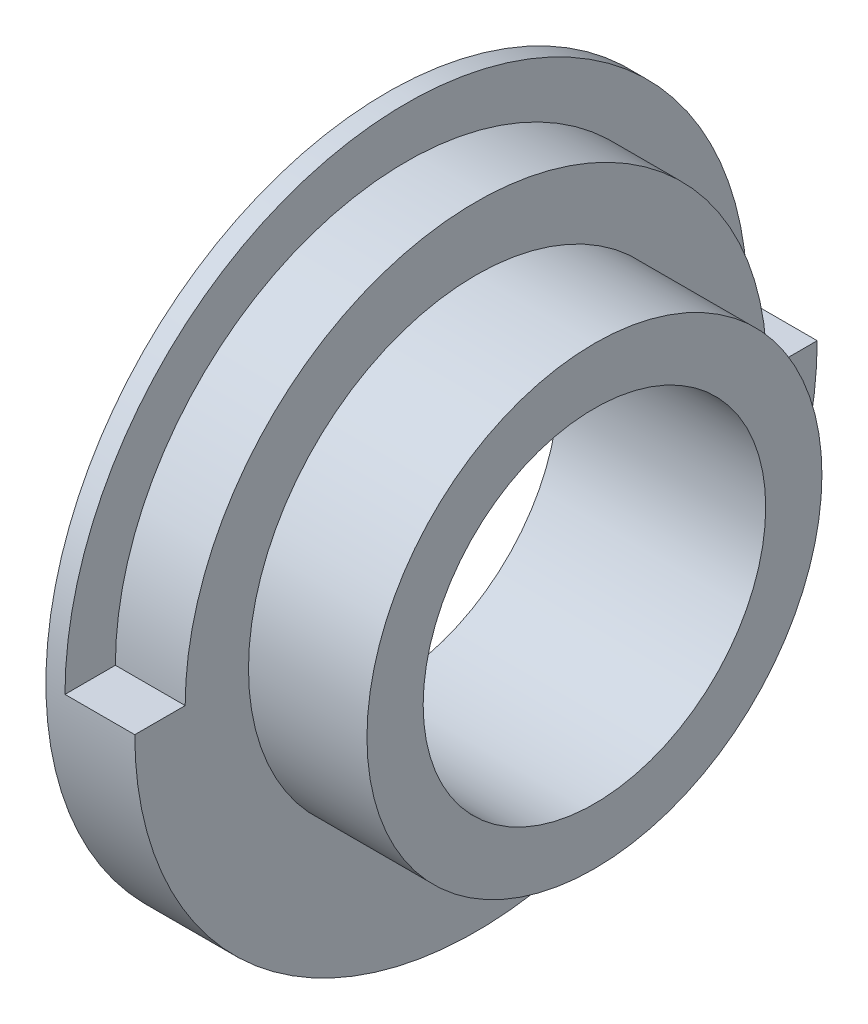
ISO-10303-21;
HEADER;
FILE_DESCRIPTION(('STEP AP214'),'2;1');
FILE_NAME('part.step','',(''),(''),'','','');
FILE_SCHEMA(('AUTOMOTIVE_DESIGN { 1 0 10303 214 1 1 1 1 }'));
ENDSEC;
DATA;
#1=APPLICATION_CONTEXT('core data for automotive mechanical design processes');
#2=APPLICATION_PROTOCOL_DEFINITION('international standard','automotive_design',2000,#1);
#3=PRODUCT_CONTEXT('',#1,'mechanical');
#4=PRODUCT('Part','Part','',(#3));
#5=PRODUCT_RELATED_PRODUCT_CATEGORY('part','',(#4));
#6=PRODUCT_DEFINITION_FORMATION('','',#4);
#7=PRODUCT_DEFINITION_CONTEXT('part definition',#1,'design');
#8=PRODUCT_DEFINITION('design','',#6,#7);
#9=PRODUCT_DEFINITION_SHAPE('','',#8);
#10=(LENGTH_UNIT() NAMED_UNIT(*) SI_UNIT(.MILLI.,.METRE.));
#11=(NAMED_UNIT(*) PLANE_ANGLE_UNIT() SI_UNIT($,.RADIAN.));
#12=(NAMED_UNIT(*) SI_UNIT($,.STERADIAN.) SOLID_ANGLE_UNIT());
#13=UNCERTAINTY_MEASURE_WITH_UNIT(LENGTH_MEASURE(1.E-05),#10,'distance_accuracy_value','');
#14=(GEOMETRIC_REPRESENTATION_CONTEXT(3) GLOBAL_UNCERTAINTY_ASSIGNED_CONTEXT((#13)) GLOBAL_UNIT_ASSIGNED_CONTEXT((#10,
#11,#12)) REPRESENTATION_CONTEXT('',''));
#15=CARTESIAN_POINT('',(0.,0.,0.));
#16=DIRECTION('',(0.,0.,1.));
#17=DIRECTION('',(1.,0.,0.));
#18=AXIS2_PLACEMENT_3D('',#15,#16,#17);
#19=CARTESIAN_POINT('',(0.,0.,0.));
#20=DIRECTION('',(1.,0.,0.));
#21=DIRECTION('',(0.,0.,-1.));
#22=AXIS2_PLACEMENT_3D('',#19,#20,#21);
#23=CYLINDRICAL_SURFACE('',#22,58.1627654003745);
#24=CARTESIAN_POINT('',(-35.3431002519891,0.,0.));
#25=DIRECTION('',(1.,0.,0.));
#26=DIRECTION('',(0.,0.,-1.));
#27=AXIS2_PLACEMENT_3D('',#24,#25,#26);
#28=CIRCLE('',#27,58.1627654003745);
#29=CARTESIAN_POINT('',(-35.3431002519891,0.,-58.1627654003745));
#30=VERTEX_POINT('',#29);
#31=EDGE_CURVE('E125',#30,#30,#28,.T.);
#32=ORIENTED_EDGE('',*,*,#31,.T.);
#33=EDGE_LOOP('',(#32));
#34=FACE_BOUND('',#33,.T.);
#35=CARTESIAN_POINT('',(-32.0893026061469,0.,0.));
#36=DIRECTION('',(-1.,0.,0.));
#37=DIRECTION('',(0.,0.,1.));
#38=AXIS2_PLACEMENT_3D('',#35,#36,#37);
#39=CIRCLE('',#38,58.1627654003745);
#40=CARTESIAN_POINT('',(-32.0893026061469,-2.03074210010919E-13,-58.1627654003745));
#41=VERTEX_POINT('',#40);
#42=CARTESIAN_POINT('',(-32.0893026061469,-2.03074210010919E-13,58.1627654003745));
#43=VERTEX_POINT('',#42);
#44=EDGE_CURVE('E11',#41,#43,#39,.F.);
#45=ORIENTED_EDGE('',*,*,#44,.F.);
#46=DIRECTION('',(1.,0.,0.));
#47=VECTOR('',#46,1.);
#48=CARTESIAN_POINT('',(0.,-2.03074210010919E-13,-58.1627654003745));
#49=LINE('',#48,#47);
#50=CARTESIAN_POINT('',(-20.1912220797044,-2.03074210010919E-13,-58.1627654003745));
#51=VERTEX_POINT('',#50);
#52=EDGE_CURVE('E110',#41,#51,#49,.T.);
#53=ORIENTED_EDGE('',*,*,#52,.T.);
#54=CARTESIAN_POINT('',(-20.1912220797044,0.,0.));
#55=DIRECTION('',(1.,0.,0.));
#56=DIRECTION('',(0.,0.,-1.));
#57=AXIS2_PLACEMENT_3D('',#54,#55,#56);
#58=CIRCLE('',#57,58.1627654003745);
#59=CARTESIAN_POINT('',(-20.1912220797044,-2.03074210010919E-13,58.1627654003745));
#60=VERTEX_POINT('',#59);
#61=EDGE_CURVE('E121',#60,#51,#58,.T.);
#62=ORIENTED_EDGE('',*,*,#61,.F.);
#63=DIRECTION('',(1.,0.,0.));
#64=VECTOR('',#63,1.);
#65=CARTESIAN_POINT('',(0.,-2.03074210010919E-13,58.1627654003745));
#66=LINE('',#65,#64);
#67=EDGE_CURVE('E55',#43,#60,#66,.T.);
#68=ORIENTED_EDGE('',*,*,#67,.F.);
#69=EDGE_LOOP('',(#45,#53,#62,#68));
#70=FACE_BOUND('',#69,.T.);
#71=ADVANCED_FACE('F39',(#34,#70),#23,.T.);
#72=CARTESIAN_POINT('',(-20.1912220797044,58.1627654003745,0.));
#73=DIRECTION('',(1.,0.,0.));
#74=DIRECTION('',(0.,0.,-1.));
#75=AXIS2_PLACEMENT_3D('',#72,#73,#74);
#76=PLANE('',#75);
#77=CARTESIAN_POINT('',(-20.1912220797044,0.,0.));
#78=DIRECTION('',(1.,0.,0.));
#79=DIRECTION('',(0.,0.,-1.));
#80=AXIS2_PLACEMENT_3D('',#77,#78,#79);
#81=CIRCLE('',#80,38.7772742093633);
#82=CARTESIAN_POINT('',(-20.1912220797044,0.,-38.7772742093633));
#83=VERTEX_POINT('',#82);
#84=EDGE_CURVE('E117',#83,#83,#81,.T.);
#85=ORIENTED_EDGE('',*,*,#84,.F.);
#86=EDGE_LOOP('',(#85));
#87=FACE_BOUND('',#86,.T.);
#88=ORIENTED_EDGE('',*,*,#61,.T.);
#89=DIRECTION('',(0.,0.,1.));
#90=VECTOR('',#89,1.);
#91=CARTESIAN_POINT('',(-20.1912220797044,0.,2.03074210010919E-13));
#92=LINE('',#91,#90);
#93=CARTESIAN_POINT('',(-20.1912220797044,-1.73073484234311E-13,-49.5702160309002));
#94=VERTEX_POINT('',#93);
#95=EDGE_CURVE('E48',#51,#94,#92,.T.);
#96=ORIENTED_EDGE('',*,*,#95,.T.);
#97=CARTESIAN_POINT('',(-20.1912220797044,0.,0.));
#98=DIRECTION('',(1.,0.,0.));
#99=DIRECTION('',(0.,0.,-1.));
#100=AXIS2_PLACEMENT_3D('',#97,#98,#99);
#101=CIRCLE('',#100,49.5702160309002);
#102=CARTESIAN_POINT('',(-20.1912220797044,-1.73073484234311E-13,49.5702160309002));
#103=VERTEX_POINT('',#102);
#104=EDGE_CURVE('E139',#103,#94,#101,.F.);
#105=ORIENTED_EDGE('',*,*,#104,.F.);
#106=DIRECTION('',(0.,0.,-1.));
#107=VECTOR('',#106,1.);
#108=CARTESIAN_POINT('',(-20.1912220797044,0.,-2.03074210010919E-13));
#109=LINE('',#108,#107);
#110=EDGE_CURVE('E99',#60,#103,#109,.T.);
#111=ORIENTED_EDGE('',*,*,#110,.F.);
#112=EDGE_LOOP('',(#88,#96,#105,#111));
#113=FACE_BOUND('',#112,.T.);
#114=ADVANCED_FACE('F143',(#87,#113),#76,.T.);
#115=CARTESIAN_POINT('',(0.,29.1959394827715,0.));
#116=DIRECTION('',(1.,0.,0.));
#117=DIRECTION('',(0.,0.,-1.));
#118=AXIS2_PLACEMENT_3D('',#115,#116,#117);
#119=PLANE('',#118);
#120=CARTESIAN_POINT('',(0.,0.,0.));
#121=DIRECTION('',(1.,0.,0.));
#122=DIRECTION('',(0.,0.,-1.));
#123=AXIS2_PLACEMENT_3D('',#120,#121,#122);
#124=CIRCLE('',#123,38.7772742093633);
#125=CARTESIAN_POINT('',(0.,0.,-38.7772742093633));
#126=VERTEX_POINT('',#125);
#127=EDGE_CURVE('E113',#126,#126,#124,.T.);
#128=ORIENTED_EDGE('',*,*,#127,.T.);
#129=EDGE_LOOP('',(#128));
#130=FACE_BOUND('',#129,.T.);
#131=CARTESIAN_POINT('',(0.,0.,0.));
#132=DIRECTION('',(1.,0.,0.));
#133=DIRECTION('',(0.,0.,-1.));
#134=AXIS2_PLACEMENT_3D('',#131,#132,#133);
#135=CIRCLE('',#134,29.1959394827715);
#136=CARTESIAN_POINT('',(0.,0.,-29.1959394827715));
#137=VERTEX_POINT('',#136);
#138=EDGE_CURVE('E133',#137,#137,#135,.T.);
#139=ORIENTED_EDGE('',*,*,#138,.F.);
#140=EDGE_LOOP('',(#139));
#141=FACE_BOUND('',#140,.T.);
#142=ADVANCED_FACE('F41',(#130,#141),#119,.T.);
#143=CARTESIAN_POINT('',(0.,0.,0.));
#144=DIRECTION('',(1.,0.,0.));
#145=DIRECTION('',(0.,0.,-1.));
#146=AXIS2_PLACEMENT_3D('',#143,#144,#145);
#147=CYLINDRICAL_SURFACE('',#146,29.1959394827715);
#148=ORIENTED_EDGE('',*,*,#138,.T.);
#149=EDGE_LOOP('',(#148));
#150=FACE_BOUND('',#149,.T.);
#151=CARTESIAN_POINT('',(-35.3431002519891,0.,0.));
#152=DIRECTION('',(1.,0.,0.));
#153=DIRECTION('',(0.,0.,-1.));
#154=AXIS2_PLACEMENT_3D('',#151,#152,#153);
#155=CIRCLE('',#154,29.1959394827715);
#156=CARTESIAN_POINT('',(-35.3431002519891,0.,-29.1959394827715));
#157=VERTEX_POINT('',#156);
#158=EDGE_CURVE('E129',#157,#157,#155,.T.);
#159=ORIENTED_EDGE('',*,*,#158,.F.);
#160=EDGE_LOOP('',(#159));
#161=FACE_BOUND('',#160,.T.);
#162=ADVANCED_FACE('F169',(#150,#161),#147,.F.);
#163=CARTESIAN_POINT('',(-35.3431002519891,29.1959394827715,0.));
#164=DIRECTION('',(-1.,0.,0.));
#165=DIRECTION('',(0.,0.,1.));
#166=AXIS2_PLACEMENT_3D('',#163,#164,#165);
#167=PLANE('',#166);
#168=ORIENTED_EDGE('',*,*,#158,.T.);
#169=EDGE_LOOP('',(#168));
#170=FACE_BOUND('',#169,.T.);
#171=ORIENTED_EDGE('',*,*,#31,.F.);
#172=EDGE_LOOP('',(#171));
#173=FACE_BOUND('',#172,.T.);
#174=ADVANCED_FACE('F166',(#170,#173),#167,.T.);
#175=CARTESIAN_POINT('',(0.,0.,0.));
#176=DIRECTION('',(1.,0.,0.));
#177=DIRECTION('',(0.,0.,-1.));
#178=AXIS2_PLACEMENT_3D('',#175,#176,#177);
#179=CYLINDRICAL_SURFACE('',#178,38.7772742093633);
#180=ORIENTED_EDGE('',*,*,#84,.T.);
#181=EDGE_LOOP('',(#180));
#182=FACE_BOUND('',#181,.T.);
#183=ORIENTED_EDGE('',*,*,#127,.F.);
#184=EDGE_LOOP('',(#183));
#185=FACE_BOUND('',#184,.T.);
#186=ADVANCED_FACE('F168',(#182,#185),#179,.T.);
#187=CARTESIAN_POINT('',(-32.0893026061469,-2.32450242266362E-13,-66.5763954343177));
#188=DIRECTION('',(-1.,0.,0.));
#189=DIRECTION('',(0.,0.,1.));
#190=AXIS2_PLACEMENT_3D('',#187,#188,#189);
#191=PLANE('',#190);
#192=ORIENTED_EDGE('',*,*,#44,.T.);
#193=DIRECTION('',(0.,0.,-1.));
#194=VECTOR('',#193,1.);
#195=CARTESIAN_POINT('',(-32.0893026061469,-2.32450242266362E-13,66.5763954343177));
#196=LINE('',#195,#194);
#197=CARTESIAN_POINT('',(-32.0893026061469,-1.73073484234311E-13,49.5702160309002));
#198=VERTEX_POINT('',#197);
#199=EDGE_CURVE('E80',#43,#198,#196,.T.);
#200=ORIENTED_EDGE('',*,*,#199,.T.);
#201=CARTESIAN_POINT('',(-32.0893026061469,0.,0.));
#202=DIRECTION('',(1.,0.,0.));
#203=DIRECTION('',(0.,0.,-1.));
#204=AXIS2_PLACEMENT_3D('',#201,#202,#203);
#205=CIRCLE('',#204,49.5702160309002);
#206=CARTESIAN_POINT('',(-32.0893026061469,-1.73073484234311E-13,-49.5702160309002));
#207=VERTEX_POINT('',#206);
#208=EDGE_CURVE('E84',#207,#198,#205,.T.);
#209=ORIENTED_EDGE('',*,*,#208,.F.);
#210=DIRECTION('',(0.,0.,1.));
#211=VECTOR('',#210,1.);
#212=CARTESIAN_POINT('',(-32.0893026061469,-2.32450242266362E-13,-66.5763954343177));
#213=LINE('',#212,#211);
#214=EDGE_CURVE('E101',#41,#207,#213,.T.);
#215=ORIENTED_EDGE('',*,*,#214,.F.);
#216=EDGE_LOOP('',(#192,#200,#209,#215));
#217=FACE_BOUND('',#216,.T.);
#218=ADVANCED_FACE('F82',(#217),#191,.F.);
#219=CARTESIAN_POINT('',(0.,0.,0.));
#220=DIRECTION('',(1.,0.,0.));
#221=DIRECTION('',(0.,0.,-1.));
#222=AXIS2_PLACEMENT_3D('',#219,#220,#221);
#223=CYLINDRICAL_SURFACE('',#222,49.5702160309002);
#224=ORIENTED_EDGE('',*,*,#104,.T.);
#225=DIRECTION('',(1.,0.,0.));
#226=VECTOR('',#225,1.);
#227=CARTESIAN_POINT('',(-32.0893026061469,-1.73073484234311E-13,-49.5702160309002));
#228=LINE('',#227,#226);
#229=EDGE_CURVE('E95',#207,#94,#228,.T.);
#230=ORIENTED_EDGE('',*,*,#229,.F.);
#231=ORIENTED_EDGE('',*,*,#208,.T.);
#232=DIRECTION('',(1.,0.,0.));
#233=VECTOR('',#232,1.);
#234=CARTESIAN_POINT('',(-32.0893026061469,-1.73073484234311E-13,49.5702160309002));
#235=LINE('',#234,#233);
#236=EDGE_CURVE('E89',#198,#103,#235,.T.);
#237=ORIENTED_EDGE('',*,*,#236,.T.);
#238=EDGE_LOOP('',(#224,#230,#231,#237));
#239=FACE_BOUND('',#238,.T.);
#240=ADVANCED_FACE('F93',(#239),#223,.T.);
#241=CARTESIAN_POINT('',(0.,0.,0.));
#242=DIRECTION('',(0.,1.,0.));
#243=DIRECTION('',(1.,0.,0.));
#244=AXIS2_PLACEMENT_3D('',#241,#242,#243);
#245=PLANE('',#244);
#246=ORIENTED_EDGE('',*,*,#214,.T.);
#247=ORIENTED_EDGE('',*,*,#229,.T.);
#248=ORIENTED_EDGE('',*,*,#95,.F.);
#249=ORIENTED_EDGE('',*,*,#52,.F.);
#250=EDGE_LOOP('',(#246,#247,#248,#249));
#251=FACE_BOUND('',#250,.T.);
#252=ADVANCED_FACE('F146',(#251),#245,.T.);
#253=CARTESIAN_POINT('',(0.,0.,0.));
#254=DIRECTION('',(0.,-1.,0.));
#255=DIRECTION('',(1.,0.,0.));
#256=AXIS2_PLACEMENT_3D('',#253,#254,#255);
#257=PLANE('',#256);
#258=ORIENTED_EDGE('',*,*,#67,.T.);
#259=ORIENTED_EDGE('',*,*,#110,.T.);
#260=ORIENTED_EDGE('',*,*,#236,.F.);
#261=ORIENTED_EDGE('',*,*,#199,.F.);
#262=EDGE_LOOP('',(#258,#259,#260,#261));
#263=FACE_BOUND('',#262,.T.);
#264=ADVANCED_FACE('F98',(#263),#257,.F.);
#265=CLOSED_SHELL('',(#71,#114,#142,#162,#174,#186,#218,#240,#252,#264));
#266=MANIFOLD_SOLID_BREP('B2',#265);
#267=ADVANCED_BREP_SHAPE_REPRESENTATION('',(#18,#266),#14);
#268=SHAPE_DEFINITION_REPRESENTATION(#9,#267);
ENDSEC;
END-ISO-10303-21;
